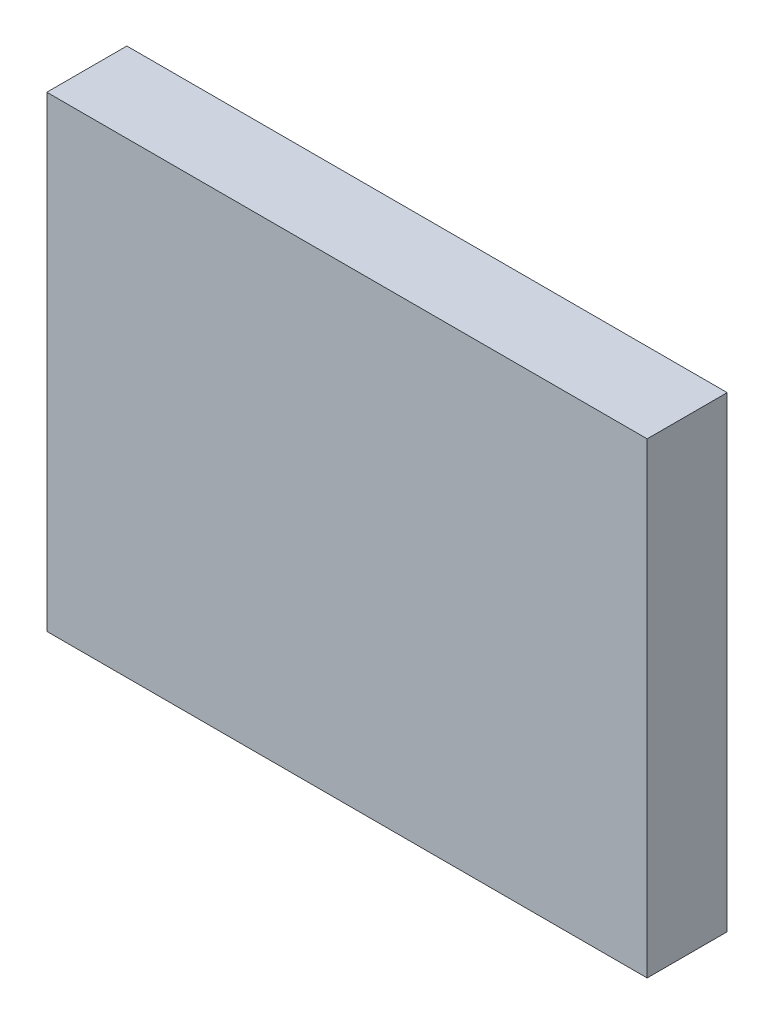
ISO-10303-21;
HEADER;
FILE_DESCRIPTION(('STEP AP214'),'2;1');
FILE_NAME('part.step','',(''),(''),'','','');
FILE_SCHEMA(('AUTOMOTIVE_DESIGN { 1 0 10303 214 1 1 1 1 }'));
ENDSEC;
DATA;
#1=APPLICATION_CONTEXT('core data for automotive mechanical design processes');
#2=APPLICATION_PROTOCOL_DEFINITION('international standard','automotive_design',2000,#1);
#3=PRODUCT_CONTEXT('',#1,'mechanical');
#4=PRODUCT('Part','Part','',(#3));
#5=PRODUCT_RELATED_PRODUCT_CATEGORY('part','',(#4));
#6=PRODUCT_DEFINITION_FORMATION('','',#4);
#7=PRODUCT_DEFINITION_CONTEXT('part definition',#1,'design');
#8=PRODUCT_DEFINITION('design','',#6,#7);
#9=PRODUCT_DEFINITION_SHAPE('','',#8);
#10=(LENGTH_UNIT() NAMED_UNIT(*) SI_UNIT(.MILLI.,.METRE.));
#11=(NAMED_UNIT(*) PLANE_ANGLE_UNIT() SI_UNIT($,.RADIAN.));
#12=(NAMED_UNIT(*) SI_UNIT($,.STERADIAN.) SOLID_ANGLE_UNIT());
#13=UNCERTAINTY_MEASURE_WITH_UNIT(LENGTH_MEASURE(1.E-05),#10,'distance_accuracy_value','');
#14=(GEOMETRIC_REPRESENTATION_CONTEXT(3) GLOBAL_UNCERTAINTY_ASSIGNED_CONTEXT((#13)) GLOBAL_UNIT_ASSIGNED_CONTEXT((#10,
#11,#12)) REPRESENTATION_CONTEXT('',''));
#15=CARTESIAN_POINT('',(0.,0.,0.));
#16=DIRECTION('',(0.,0.,1.));
#17=DIRECTION('',(1.,0.,0.));
#18=AXIS2_PLACEMENT_3D('',#15,#16,#17);
#19=CARTESIAN_POINT('',(4.5,-3.5,1.2));
#20=DIRECTION('',(-1.,0.,0.));
#21=DIRECTION('',(0.,0.,1.));
#22=AXIS2_PLACEMENT_3D('',#19,#20,#21);
#23=PLANE('',#22);
#24=DIRECTION('',(0.,1.,0.));
#25=VECTOR('',#24,1.);
#26=CARTESIAN_POINT('',(4.5,-3.5,0.));
#27=LINE('',#26,#25);
#28=CARTESIAN_POINT('',(4.5,-3.5,0.));
#29=VERTEX_POINT('',#28);
#30=CARTESIAN_POINT('',(4.5,3.5,0.));
#31=VERTEX_POINT('',#30);
#32=EDGE_CURVE('E101',#29,#31,#27,.T.);
#33=ORIENTED_EDGE('',*,*,#32,.T.);
#34=DIRECTION('',(0.,0.,-1.));
#35=VECTOR('',#34,1.);
#36=CARTESIAN_POINT('',(4.5,3.5,1.2));
#37=LINE('',#36,#35);
#38=CARTESIAN_POINT('',(4.5,3.5,1.2));
#39=VERTEX_POINT('',#38);
#40=EDGE_CURVE('E11',#39,#31,#37,.T.);
#41=ORIENTED_EDGE('',*,*,#40,.F.);
#42=DIRECTION('',(0.,1.,0.));
#43=VECTOR('',#42,1.);
#44=CARTESIAN_POINT('',(4.5,-3.5,1.2));
#45=LINE('',#44,#43);
#46=CARTESIAN_POINT('',(4.5,-3.5,1.2));
#47=VERTEX_POINT('',#46);
#48=EDGE_CURVE('E89',#47,#39,#45,.T.);
#49=ORIENTED_EDGE('',*,*,#48,.F.);
#50=DIRECTION('',(0.,0.,-1.));
#51=VECTOR('',#50,1.);
#52=CARTESIAN_POINT('',(4.5,-3.5,1.2));
#53=LINE('',#52,#51);
#54=EDGE_CURVE('E97',#47,#29,#53,.T.);
#55=ORIENTED_EDGE('',*,*,#54,.T.);
#56=EDGE_LOOP('',(#33,#41,#49,#55));
#57=FACE_BOUND('',#56,.T.);
#58=ADVANCED_FACE('F38',(#57),#23,.F.);
#59=CARTESIAN_POINT('',(4.5,3.5,1.2));
#60=DIRECTION('',(0.,-1.,0.));
#61=DIRECTION('',(1.,0.,0.));
#62=AXIS2_PLACEMENT_3D('',#59,#60,#61);
#63=PLANE('',#62);
#64=DIRECTION('',(-1.,0.,0.));
#65=VECTOR('',#64,1.);
#66=CARTESIAN_POINT('',(4.5,3.5,0.));
#67=LINE('',#66,#65);
#68=CARTESIAN_POINT('',(-4.5,3.5,0.));
#69=VERTEX_POINT('',#68);
#70=EDGE_CURVE('E93',#31,#69,#67,.T.);
#71=ORIENTED_EDGE('',*,*,#70,.T.);
#72=DIRECTION('',(0.,0.,-1.));
#73=VECTOR('',#72,1.);
#74=CARTESIAN_POINT('',(-4.5,3.5,1.2));
#75=LINE('',#74,#73);
#76=CARTESIAN_POINT('',(-4.5,3.5,1.2));
#77=VERTEX_POINT('',#76);
#78=EDGE_CURVE('E46',#77,#69,#75,.T.);
#79=ORIENTED_EDGE('',*,*,#78,.F.);
#80=DIRECTION('',(-1.,0.,0.));
#81=VECTOR('',#80,1.);
#82=CARTESIAN_POINT('',(4.5,3.5,1.2));
#83=LINE('',#82,#81);
#84=EDGE_CURVE('E84',#39,#77,#83,.T.);
#85=ORIENTED_EDGE('',*,*,#84,.F.);
#86=ORIENTED_EDGE('',*,*,#40,.T.);
#87=EDGE_LOOP('',(#71,#79,#85,#86));
#88=FACE_BOUND('',#87,.T.);
#89=ADVANCED_FACE('F92',(#88),#63,.F.);
#90=CARTESIAN_POINT('',(-4.5,3.5,1.2));
#91=DIRECTION('',(1.,0.,0.));
#92=DIRECTION('',(0.,1.,0.));
#93=AXIS2_PLACEMENT_3D('',#90,#91,#92);
#94=PLANE('',#93);
#95=DIRECTION('',(0.,-1.,0.));
#96=VECTOR('',#95,1.);
#97=CARTESIAN_POINT('',(-4.5,3.5,0.));
#98=LINE('',#97,#96);
#99=CARTESIAN_POINT('',(-4.5,-3.5,0.));
#100=VERTEX_POINT('',#99);
#101=EDGE_CURVE('E71',#69,#100,#98,.T.);
#102=ORIENTED_EDGE('',*,*,#101,.T.);
#103=DIRECTION('',(0.,0.,-1.));
#104=VECTOR('',#103,1.);
#105=CARTESIAN_POINT('',(-4.5,-3.5,1.2));
#106=LINE('',#105,#104);
#107=CARTESIAN_POINT('',(-4.5,-3.5,1.2));
#108=VERTEX_POINT('',#107);
#109=EDGE_CURVE('E94',#108,#100,#106,.T.);
#110=ORIENTED_EDGE('',*,*,#109,.F.);
#111=DIRECTION('',(0.,-1.,0.));
#112=VECTOR('',#111,1.);
#113=CARTESIAN_POINT('',(-4.5,3.5,1.2));
#114=LINE('',#113,#112);
#115=EDGE_CURVE('E87',#77,#108,#114,.T.);
#116=ORIENTED_EDGE('',*,*,#115,.F.);
#117=ORIENTED_EDGE('',*,*,#78,.T.);
#118=EDGE_LOOP('',(#102,#110,#116,#117));
#119=FACE_BOUND('',#118,.T.);
#120=ADVANCED_FACE('F95',(#119),#94,.F.);
#121=CARTESIAN_POINT('',(-4.5,-3.5,1.2));
#122=DIRECTION('',(0.,1.,0.));
#123=DIRECTION('',(0.,0.,1.));
#124=AXIS2_PLACEMENT_3D('',#121,#122,#123);
#125=PLANE('',#124);
#126=DIRECTION('',(1.,0.,0.));
#127=VECTOR('',#126,1.);
#128=CARTESIAN_POINT('',(-4.5,-3.5,0.));
#129=LINE('',#128,#127);
#130=EDGE_CURVE('E77',#100,#29,#129,.T.);
#131=ORIENTED_EDGE('',*,*,#130,.T.);
#132=ORIENTED_EDGE('',*,*,#54,.F.);
#133=DIRECTION('',(1.,0.,0.));
#134=VECTOR('',#133,1.);
#135=CARTESIAN_POINT('',(-4.5,-3.5,1.2));
#136=LINE('',#135,#134);
#137=EDGE_CURVE('E54',#108,#47,#136,.T.);
#138=ORIENTED_EDGE('',*,*,#137,.F.);
#139=ORIENTED_EDGE('',*,*,#109,.T.);
#140=EDGE_LOOP('',(#131,#132,#138,#139));
#141=FACE_BOUND('',#140,.T.);
#142=ADVANCED_FACE('F108',(#141),#125,.F.);
#143=CARTESIAN_POINT('',(0.,0.,1.2));
#144=DIRECTION('',(0.,0.,1.));
#145=DIRECTION('',(1.,0.,0.));
#146=AXIS2_PLACEMENT_3D('',#143,#144,#145);
#147=PLANE('',#146);
#148=ORIENTED_EDGE('',*,*,#48,.T.);
#149=ORIENTED_EDGE('',*,*,#84,.T.);
#150=ORIENTED_EDGE('',*,*,#115,.T.);
#151=ORIENTED_EDGE('',*,*,#137,.T.);
#152=EDGE_LOOP('',(#148,#149,#150,#151));
#153=FACE_BOUND('',#152,.T.);
#154=ADVANCED_FACE('F85',(#153),#147,.T.);
#155=CARTESIAN_POINT('',(0.,0.,0.));
#156=DIRECTION('',(0.,0.,1.));
#157=DIRECTION('',(1.,0.,0.));
#158=AXIS2_PLACEMENT_3D('',#155,#156,#157);
#159=PLANE('',#158);
#160=ORIENTED_EDGE('',*,*,#32,.F.);
#161=ORIENTED_EDGE('',*,*,#130,.F.);
#162=ORIENTED_EDGE('',*,*,#101,.F.);
#163=ORIENTED_EDGE('',*,*,#70,.F.);
#164=EDGE_LOOP('',(#160,#161,#162,#163));
#165=FACE_BOUND('',#164,.T.);
#166=ADVANCED_FACE('F111',(#165),#159,.F.);
#167=CLOSED_SHELL('',(#58,#89,#120,#142,#154,#166));
#168=MANIFOLD_SOLID_BREP('B2',#167);
#169=ADVANCED_BREP_SHAPE_REPRESENTATION('',(#18,#168),#14);
#170=SHAPE_DEFINITION_REPRESENTATION(#9,#169);
ENDSEC;
END-ISO-10303-21;
